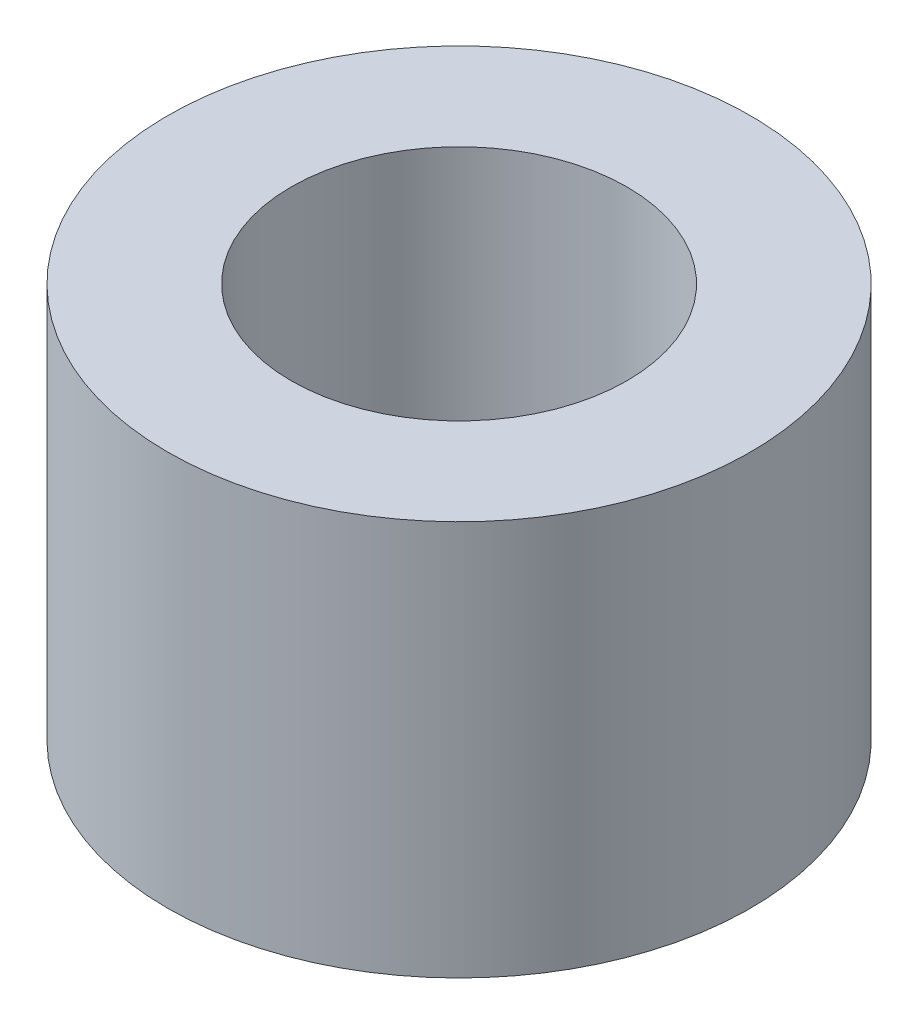
ISO-10303-21;
HEADER;
FILE_DESCRIPTION(('STEP AP214'),'2;1');
FILE_NAME('part.step','',(''),(''),'','','');
FILE_SCHEMA(('AUTOMOTIVE_DESIGN { 1 0 10303 214 1 1 1 1 }'));
ENDSEC;
DATA;
#1=APPLICATION_CONTEXT('core data for automotive mechanical design processes');
#2=APPLICATION_PROTOCOL_DEFINITION('international standard','automotive_design',2000,#1);
#3=PRODUCT_CONTEXT('',#1,'mechanical');
#4=PRODUCT('Part','Part','',(#3));
#5=PRODUCT_RELATED_PRODUCT_CATEGORY('part','',(#4));
#6=PRODUCT_DEFINITION_FORMATION('','',#4);
#7=PRODUCT_DEFINITION_CONTEXT('part definition',#1,'design');
#8=PRODUCT_DEFINITION('design','',#6,#7);
#9=PRODUCT_DEFINITION_SHAPE('','',#8);
#10=(LENGTH_UNIT() NAMED_UNIT(*) SI_UNIT(.MILLI.,.METRE.));
#11=(NAMED_UNIT(*) PLANE_ANGLE_UNIT() SI_UNIT($,.RADIAN.));
#12=(NAMED_UNIT(*) SI_UNIT($,.STERADIAN.) SOLID_ANGLE_UNIT());
#13=UNCERTAINTY_MEASURE_WITH_UNIT(LENGTH_MEASURE(1.E-05),#10,'distance_accuracy_value','');
#14=(GEOMETRIC_REPRESENTATION_CONTEXT(3) GLOBAL_UNCERTAINTY_ASSIGNED_CONTEXT((#13)) GLOBAL_UNIT_ASSIGNED_CONTEXT((#10,
#11,#12)) REPRESENTATION_CONTEXT('',''));
#15=CARTESIAN_POINT('',(0.,0.,0.));
#16=DIRECTION('',(0.,0.,1.));
#17=DIRECTION('',(1.,0.,0.));
#18=AXIS2_PLACEMENT_3D('',#15,#16,#17);
#19=CARTESIAN_POINT('',(0.,4.,0.));
#20=DIRECTION('',(0.,1.,0.));
#21=DIRECTION('',(0.,0.,1.));
#22=AXIS2_PLACEMENT_3D('',#19,#20,#21);
#23=PLANE('',#22);
#24=CARTESIAN_POINT('',(0.,4.,0.));
#25=DIRECTION('',(0.,1.,0.));
#26=DIRECTION('',(0.,0.,1.));
#27=AXIS2_PLACEMENT_3D('',#24,#25,#26);
#28=CIRCLE('',#27,2.95);
#29=CARTESIAN_POINT('',(0.,4.,2.95));
#30=VERTEX_POINT('',#29);
#31=EDGE_CURVE('E10',#30,#30,#28,.T.);
#32=ORIENTED_EDGE('',*,*,#31,.T.);
#33=EDGE_LOOP('',(#32));
#34=FACE_BOUND('',#33,.T.);
#35=CARTESIAN_POINT('',(0.,4.,0.));
#36=DIRECTION('',(0.,1.,0.));
#37=DIRECTION('',(0.,0.,1.));
#38=AXIS2_PLACEMENT_3D('',#35,#36,#37);
#39=CIRCLE('',#38,1.7);
#40=CARTESIAN_POINT('',(0.,4.,1.7));
#41=VERTEX_POINT('',#40);
#42=EDGE_CURVE('E54',#41,#41,#39,.T.);
#43=ORIENTED_EDGE('',*,*,#42,.F.);
#44=EDGE_LOOP('',(#43));
#45=FACE_BOUND('',#44,.T.);
#46=ADVANCED_FACE('F41',(#34,#45),#23,.T.);
#47=CARTESIAN_POINT('',(0.,0.,0.));
#48=DIRECTION('',(0.,1.,0.));
#49=DIRECTION('',(0.,0.,1.));
#50=AXIS2_PLACEMENT_3D('',#47,#48,#49);
#51=PLANE('',#50);
#52=CARTESIAN_POINT('',(0.,0.,0.));
#53=DIRECTION('',(0.,1.,0.));
#54=DIRECTION('',(0.,0.,1.));
#55=AXIS2_PLACEMENT_3D('',#52,#53,#54);
#56=CIRCLE('',#55,2.95);
#57=CARTESIAN_POINT('',(0.,0.,2.95));
#58=VERTEX_POINT('',#57);
#59=EDGE_CURVE('E45',#58,#58,#56,.T.);
#60=ORIENTED_EDGE('',*,*,#59,.F.);
#61=EDGE_LOOP('',(#60));
#62=FACE_BOUND('',#61,.T.);
#63=CARTESIAN_POINT('',(0.,0.,0.));
#64=DIRECTION('',(0.,1.,0.));
#65=DIRECTION('',(0.,0.,1.));
#66=AXIS2_PLACEMENT_3D('',#63,#64,#65);
#67=CIRCLE('',#66,1.7);
#68=CARTESIAN_POINT('',(0.,0.,1.7));
#69=VERTEX_POINT('',#68);
#70=EDGE_CURVE('E56',#69,#69,#67,.T.);
#71=ORIENTED_EDGE('',*,*,#70,.T.);
#72=EDGE_LOOP('',(#71));
#73=FACE_BOUND('',#72,.T.);
#74=ADVANCED_FACE('F68',(#62,#73),#51,.F.);
#75=CARTESIAN_POINT('',(0.,4.,0.));
#76=DIRECTION('',(0.,-1.,0.));
#77=DIRECTION('',(0.,0.,-1.));
#78=AXIS2_PLACEMENT_3D('',#75,#76,#77);
#79=CYLINDRICAL_SURFACE('',#78,2.95);
#80=ORIENTED_EDGE('',*,*,#31,.F.);
#81=EDGE_LOOP('',(#80));
#82=FACE_BOUND('',#81,.T.);
#83=ORIENTED_EDGE('',*,*,#59,.T.);
#84=EDGE_LOOP('',(#83));
#85=FACE_BOUND('',#84,.T.);
#86=ADVANCED_FACE('F43',(#82,#85),#79,.T.);
#87=CARTESIAN_POINT('',(0.,4.,0.));
#88=DIRECTION('',(0.,-1.,0.));
#89=DIRECTION('',(0.,0.,-1.));
#90=AXIS2_PLACEMENT_3D('',#87,#88,#89);
#91=CYLINDRICAL_SURFACE('',#90,1.7);
#92=ORIENTED_EDGE('',*,*,#42,.T.);
#93=EDGE_LOOP('',(#92));
#94=FACE_BOUND('',#93,.T.);
#95=ORIENTED_EDGE('',*,*,#70,.F.);
#96=EDGE_LOOP('',(#95));
#97=FACE_BOUND('',#96,.T.);
#98=ADVANCED_FACE('F64',(#94,#97),#91,.F.);
#99=CLOSED_SHELL('',(#46,#74,#86,#98));
#100=MANIFOLD_SOLID_BREP('B2',#99);
#101=ADVANCED_BREP_SHAPE_REPRESENTATION('',(#18,#100),#14);
#102=SHAPE_DEFINITION_REPRESENTATION(#9,#101);
ENDSEC;
END-ISO-10303-21;
